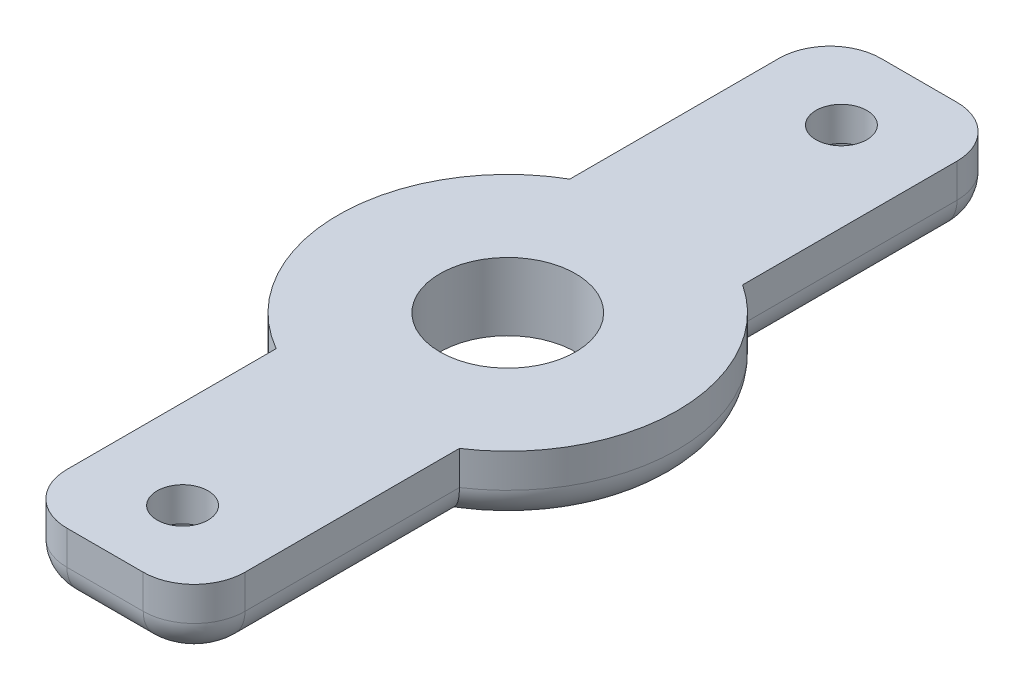
ISO-10303-21;
HEADER;
FILE_DESCRIPTION(('STEP AP214'),'2;1');
FILE_NAME('part.step','',(''),(''),'','','');
FILE_SCHEMA(('AUTOMOTIVE_DESIGN { 1 0 10303 214 1 1 1 1 }'));
ENDSEC;
DATA;
#1=APPLICATION_CONTEXT('core data for automotive mechanical design processes');
#2=APPLICATION_PROTOCOL_DEFINITION('international standard','automotive_design',2000,#1);
#3=PRODUCT_CONTEXT('',#1,'mechanical');
#4=PRODUCT('Part','Part','',(#3));
#5=PRODUCT_RELATED_PRODUCT_CATEGORY('part','',(#4));
#6=PRODUCT_DEFINITION_FORMATION('','',#4);
#7=PRODUCT_DEFINITION_CONTEXT('part definition',#1,'design');
#8=PRODUCT_DEFINITION('design','',#6,#7);
#9=PRODUCT_DEFINITION_SHAPE('','',#8);
#10=(LENGTH_UNIT() NAMED_UNIT(*) SI_UNIT(.MILLI.,.METRE.));
#11=(NAMED_UNIT(*) PLANE_ANGLE_UNIT() SI_UNIT($,.RADIAN.));
#12=(NAMED_UNIT(*) SI_UNIT($,.STERADIAN.) SOLID_ANGLE_UNIT());
#13=UNCERTAINTY_MEASURE_WITH_UNIT(LENGTH_MEASURE(1.E-05),#10,'distance_accuracy_value','');
#14=(GEOMETRIC_REPRESENTATION_CONTEXT(3) GLOBAL_UNCERTAINTY_ASSIGNED_CONTEXT((#13)) GLOBAL_UNIT_ASSIGNED_CONTEXT((#10,
#11,#12)) REPRESENTATION_CONTEXT('',''));
#15=CARTESIAN_POINT('',(0.,0.,0.));
#16=DIRECTION('',(0.,0.,1.));
#17=DIRECTION('',(1.,0.,0.));
#18=AXIS2_PLACEMENT_3D('',#15,#16,#17);
#19=CARTESIAN_POINT('',(5.25,4.,21.));
#20=DIRECTION('',(-1.,0.,0.));
#21=DIRECTION('',(0.,0.,1.));
#22=AXIS2_PLACEMENT_3D('',#19,#20,#21);
#23=PLANE('',#22);
#24=DIRECTION('',(0.,-1.,0.));
#25=VECTOR('',#24,1.);
#26=CARTESIAN_POINT('',(5.25,4.,-8.35164654424503));
#27=LINE('',#26,#25);
#28=CARTESIAN_POINT('',(5.25,4.,-8.35164654424502));
#29=VERTEX_POINT('',#28);
#30=CARTESIAN_POINT('',(5.25,2.,-8.35164654424503));
#31=VERTEX_POINT('',#30);
#32=EDGE_CURVE('E481',#29,#31,#27,.T.);
#33=ORIENTED_EDGE('',*,*,#32,.T.);
#34=DIRECTION('',(0.,0.,-1.));
#35=VECTOR('',#34,1.);
#36=CARTESIAN_POINT('',(5.25,2.,21.));
#37=LINE('',#36,#35);
#38=CARTESIAN_POINT('',(5.25000000000001,2.,-21.));
#39=VERTEX_POINT('',#38);
#40=EDGE_CURVE('E207',#31,#39,#37,.T.);
#41=ORIENTED_EDGE('',*,*,#40,.T.);
#42=DIRECTION('',(0.,-1.,0.));
#43=VECTOR('',#42,1.);
#44=CARTESIAN_POINT('',(5.25000000000001,4.,-21.));
#45=LINE('',#44,#43);
#46=CARTESIAN_POINT('',(5.25000000000001,4.,-21.));
#47=VERTEX_POINT('',#46);
#48=EDGE_CURVE('E189',#47,#39,#45,.T.);
#49=ORIENTED_EDGE('',*,*,#48,.F.);
#50=DIRECTION('',(0.,0.,-1.));
#51=VECTOR('',#50,1.);
#52=CARTESIAN_POINT('',(5.25,4.,21.));
#53=LINE('',#52,#51);
#54=EDGE_CURVE('E172',#29,#47,#53,.T.);
#55=ORIENTED_EDGE('',*,*,#54,.F.);
#56=EDGE_LOOP('',(#33,#41,#49,#55));
#57=FACE_BOUND('',#56,.T.);
#58=ADVANCED_FACE('F33',(#57),#23,.F.);
#59=CARTESIAN_POINT('',(-5.25,4.,-21.));
#60=DIRECTION('',(1.,0.,0.));
#61=DIRECTION('',(0.,0.,-1.));
#62=AXIS2_PLACEMENT_3D('',#59,#60,#61);
#63=PLANE('',#62);
#64=DIRECTION('',(0.,-1.,0.));
#65=VECTOR('',#64,1.);
#66=CARTESIAN_POINT('',(-5.25,4.,8.66025403784439));
#67=LINE('',#66,#65);
#68=CARTESIAN_POINT('',(-5.25,4.,8.66025403784439));
#69=VERTEX_POINT('',#68);
#70=CARTESIAN_POINT('',(-5.25,2.,8.66025403784439));
#71=VERTEX_POINT('',#70);
#72=EDGE_CURVE('E191',#69,#71,#67,.T.);
#73=ORIENTED_EDGE('',*,*,#72,.T.);
#74=DIRECTION('',(0.,0.,1.));
#75=VECTOR('',#74,1.);
#76=CARTESIAN_POINT('',(-5.25,2.,-21.));
#77=LINE('',#76,#75);
#78=CARTESIAN_POINT('',(-5.25,2.,21.));
#79=VERTEX_POINT('',#78);
#80=EDGE_CURVE('E42',#71,#79,#77,.T.);
#81=ORIENTED_EDGE('',*,*,#80,.T.);
#82=DIRECTION('',(0.,-1.,0.));
#83=VECTOR('',#82,1.);
#84=CARTESIAN_POINT('',(-5.25,4.,21.));
#85=LINE('',#84,#83);
#86=CARTESIAN_POINT('',(-5.25,4.,21.));
#87=VERTEX_POINT('',#86);
#88=EDGE_CURVE('E447',#87,#79,#85,.T.);
#89=ORIENTED_EDGE('',*,*,#88,.F.);
#90=DIRECTION('',(0.,0.,1.));
#91=VECTOR('',#90,1.);
#92=CARTESIAN_POINT('',(-5.25,4.,-21.));
#93=LINE('',#92,#91);
#94=EDGE_CURVE('E462',#69,#87,#93,.T.);
#95=ORIENTED_EDGE('',*,*,#94,.F.);
#96=EDGE_LOOP('',(#73,#81,#89,#95));
#97=FACE_BOUND('',#96,.T.);
#98=ADVANCED_FACE('F340',(#97),#63,.F.);
#99=CARTESIAN_POINT('',(0.,10.,-19.4285218224936));
#100=DIRECTION('',(0.,-1.,0.));
#101=DIRECTION('',(0.,0.,-1.));
#102=AXIS2_PLACEMENT_3D('',#99,#100,#101);
#103=CYLINDRICAL_SURFACE('',#102,1.50000000000003);
#104=CARTESIAN_POINT('',(0.,4.,-19.4285218224936));
#105=DIRECTION('',(0.,1.,0.));
#106=DIRECTION('',(0.,0.,1.));
#107=AXIS2_PLACEMENT_3D('',#104,#105,#106);
#108=CIRCLE('',#107,1.50000000000003);
#109=CARTESIAN_POINT('',(0.,4.,-17.9285218224935));
#110=VERTEX_POINT('',#109);
#111=EDGE_CURVE('E204',#110,#110,#108,.T.);
#112=ORIENTED_EDGE('',*,*,#111,.T.);
#113=EDGE_LOOP('',(#112));
#114=FACE_BOUND('',#113,.T.);
#115=CARTESIAN_POINT('',(0.,2.,-19.4285218224936));
#116=DIRECTION('',(0.,-1.,0.));
#117=DIRECTION('',(0.,0.,-1.));
#118=AXIS2_PLACEMENT_3D('',#115,#116,#117);
#119=CIRCLE('',#118,1.50000000000003);
#120=CARTESIAN_POINT('',(0.,2.,-20.9285218224936));
#121=VERTEX_POINT('',#120);
#122=EDGE_CURVE('E201',#121,#121,#119,.F.);
#123=ORIENTED_EDGE('',*,*,#122,.F.);
#124=EDGE_LOOP('',(#123));
#125=FACE_BOUND('',#124,.T.);
#126=ADVANCED_FACE('F346',(#114,#125),#103,.F.);
#127=CARTESIAN_POINT('',(0.,10.,19.4285218224936));
#128=DIRECTION('',(0.,-1.,0.));
#129=DIRECTION('',(0.,0.,-1.));
#130=AXIS2_PLACEMENT_3D('',#127,#128,#129);
#131=CYLINDRICAL_SURFACE('',#130,1.5);
#132=CARTESIAN_POINT('',(0.,4.,19.4285218224936));
#133=DIRECTION('',(0.,1.,0.));
#134=DIRECTION('',(0.,0.,1.));
#135=AXIS2_PLACEMENT_3D('',#132,#133,#134);
#136=CIRCLE('',#135,1.5);
#137=CARTESIAN_POINT('',(0.,4.,20.9285218224936));
#138=VERTEX_POINT('',#137);
#139=EDGE_CURVE('E470',#138,#138,#136,.T.);
#140=ORIENTED_EDGE('',*,*,#139,.T.);
#141=EDGE_LOOP('',(#140));
#142=FACE_BOUND('',#141,.T.);
#143=CARTESIAN_POINT('',(0.,2.,19.4285218224936));
#144=DIRECTION('',(0.,-1.,0.));
#145=DIRECTION('',(0.,0.,-1.));
#146=AXIS2_PLACEMENT_3D('',#143,#144,#145);
#147=CIRCLE('',#146,1.5);
#148=CARTESIAN_POINT('',(0.,2.,17.9285218224936));
#149=VERTEX_POINT('',#148);
#150=EDGE_CURVE('E198',#149,#149,#147,.F.);
#151=ORIENTED_EDGE('',*,*,#150,.F.);
#152=EDGE_LOOP('',(#151));
#153=FACE_BOUND('',#152,.T.);
#154=ADVANCED_FACE('F369',(#142,#153),#131,.F.);
#155=CARTESIAN_POINT('',(2.25,4.,21.));
#156=DIRECTION('',(0.,1.,0.));
#157=DIRECTION('',(0.,0.,1.));
#158=AXIS2_PLACEMENT_3D('',#155,#156,#157);
#159=PLANE('',#158);
#160=CARTESIAN_POINT('',(5.25,4.,21.));
#161=VERTEX_POINT('',#160);
#162=CARTESIAN_POINT('',(5.25,4.,8.35164654424504));
#163=VERTEX_POINT('',#162);
#164=EDGE_CURVE('E160',#161,#163,#53,.T.);
#165=ORIENTED_EDGE('',*,*,#164,.T.);
#166=CARTESIAN_POINT('',(-0.25,4.,0.));
#167=DIRECTION('',(0.,-1.,0.));
#168=DIRECTION('',(0.,0.,-1.));
#169=AXIS2_PLACEMENT_3D('',#166,#167,#168);
#170=CIRCLE('',#169,10.);
#171=EDGE_CURVE('E491',#29,#163,#170,.T.);
#172=ORIENTED_EDGE('',*,*,#171,.F.);
#173=ORIENTED_EDGE('',*,*,#54,.T.);
#174=CARTESIAN_POINT('',(2.25,4.,-21.));
#175=DIRECTION('',(0.,1.,0.));
#176=DIRECTION('',(0.,0.,1.));
#177=AXIS2_PLACEMENT_3D('',#174,#175,#176);
#178=CIRCLE('',#177,3.00000000000001);
#179=CARTESIAN_POINT('',(2.24999999999998,4.,-24.));
#180=VERTEX_POINT('',#179);
#181=EDGE_CURVE('E171',#47,#180,#178,.T.);
#182=ORIENTED_EDGE('',*,*,#181,.T.);
#183=DIRECTION('',(-1.,0.,0.));
#184=VECTOR('',#183,1.);
#185=CARTESIAN_POINT('',(2.24999999999998,4.,-24.));
#186=LINE('',#185,#184);
#187=CARTESIAN_POINT('',(-2.24999999999998,4.,-24.));
#188=VERTEX_POINT('',#187);
#189=EDGE_CURVE('E398',#180,#188,#186,.T.);
#190=ORIENTED_EDGE('',*,*,#189,.T.);
#191=CARTESIAN_POINT('',(-2.25,4.,-21.));
#192=DIRECTION('',(0.,1.,0.));
#193=DIRECTION('',(0.,0.,1.));
#194=AXIS2_PLACEMENT_3D('',#191,#192,#193);
#195=CIRCLE('',#194,3.);
#196=CARTESIAN_POINT('',(-5.25,4.,-21.));
#197=VERTEX_POINT('',#196);
#198=EDGE_CURVE('E463',#188,#197,#195,.T.);
#199=ORIENTED_EDGE('',*,*,#198,.T.);
#200=CARTESIAN_POINT('',(-5.25,4.,-8.66025403784439));
#201=VERTEX_POINT('',#200);
#202=EDGE_CURVE('E446',#197,#201,#93,.T.);
#203=ORIENTED_EDGE('',*,*,#202,.T.);
#204=EDGE_CURVE('E492',#69,#201,#170,.T.);
#205=ORIENTED_EDGE('',*,*,#204,.F.);
#206=ORIENTED_EDGE('',*,*,#94,.T.);
#207=CARTESIAN_POINT('',(-2.25,4.,21.));
#208=DIRECTION('',(0.,1.,0.));
#209=DIRECTION('',(0.,0.,1.));
#210=AXIS2_PLACEMENT_3D('',#207,#208,#209);
#211=CIRCLE('',#210,3.);
#212=CARTESIAN_POINT('',(-2.24999999999998,4.,24.));
#213=VERTEX_POINT('',#212);
#214=EDGE_CURVE('E459',#87,#213,#211,.T.);
#215=ORIENTED_EDGE('',*,*,#214,.T.);
#216=DIRECTION('',(1.,0.,0.));
#217=VECTOR('',#216,1.);
#218=CARTESIAN_POINT('',(-2.24999999999998,4.,24.));
#219=LINE('',#218,#217);
#220=CARTESIAN_POINT('',(2.24999999999998,4.,24.));
#221=VERTEX_POINT('',#220);
#222=EDGE_CURVE('E179',#213,#221,#219,.T.);
#223=ORIENTED_EDGE('',*,*,#222,.T.);
#224=CARTESIAN_POINT('',(2.25,4.,21.));
#225=DIRECTION('',(0.,1.,0.));
#226=DIRECTION('',(0.,0.,1.));
#227=AXIS2_PLACEMENT_3D('',#224,#225,#226);
#228=CIRCLE('',#227,3.00000000000001);
#229=EDGE_CURVE('E175',#221,#161,#228,.T.);
#230=ORIENTED_EDGE('',*,*,#229,.T.);
#231=EDGE_LOOP('',(#165,#172,#173,#182,#190,#199,#203,#205,#206,#215,#223,#230));
#232=FACE_BOUND('',#231,.T.);
#233=ORIENTED_EDGE('',*,*,#139,.F.);
#234=EDGE_LOOP('',(#233));
#235=FACE_BOUND('',#234,.T.);
#236=CARTESIAN_POINT('',(-0.25,4.,0.));
#237=DIRECTION('',(0.,1.,0.));
#238=DIRECTION('',(0.,0.,1.));
#239=AXIS2_PLACEMENT_3D('',#236,#237,#238);
#240=CIRCLE('',#239,4.);
#241=CARTESIAN_POINT('',(-0.25,4.,4.));
#242=VERTEX_POINT('',#241);
#243=EDGE_CURVE('E183',#242,#242,#240,.T.);
#244=ORIENTED_EDGE('',*,*,#243,.F.);
#245=EDGE_LOOP('',(#244));
#246=FACE_BOUND('',#245,.T.);
#247=ORIENTED_EDGE('',*,*,#111,.F.);
#248=EDGE_LOOP('',(#247));
#249=FACE_BOUND('',#248,.T.);
#250=ADVANCED_FACE('F176',(#232,#235,#246,#249),#159,.T.);
#251=CARTESIAN_POINT('',(2.25,0.,21.));
#252=DIRECTION('',(0.,1.,0.));
#253=DIRECTION('',(0.,0.,1.));
#254=AXIS2_PLACEMENT_3D('',#251,#252,#253);
#255=PLANE('',#254);
#256=DIRECTION('',(0.,0.,-1.));
#257=VECTOR('',#256,1.);
#258=CARTESIAN_POINT('',(3.25,0.,21.));
#259=LINE('',#258,#257);
#260=CARTESIAN_POINT('',(3.25000000000001,0.,-21.));
#261=VERTEX_POINT('',#260);
#262=CARTESIAN_POINT('',(3.25,0.,-7.19374728496908));
#263=VERTEX_POINT('',#262);
#264=EDGE_CURVE('E230',#261,#263,#259,.F.);
#265=ORIENTED_EDGE('',*,*,#264,.T.);
#266=CARTESIAN_POINT('',(-0.25,0.,0.));
#267=DIRECTION('',(0.,1.,0.));
#268=DIRECTION('',(0.,0.,1.));
#269=AXIS2_PLACEMENT_3D('',#266,#267,#268);
#270=CIRCLE('',#269,8.);
#271=CARTESIAN_POINT('',(3.25,0.,7.19374728496908));
#272=VERTEX_POINT('',#271);
#273=EDGE_CURVE('E233',#263,#272,#270,.F.);
#274=ORIENTED_EDGE('',*,*,#273,.T.);
#275=DIRECTION('',(0.,0.,-1.));
#276=VECTOR('',#275,1.);
#277=CARTESIAN_POINT('',(3.25,0.,21.));
#278=LINE('',#277,#276);
#279=CARTESIAN_POINT('',(3.25000000000001,0.,21.));
#280=VERTEX_POINT('',#279);
#281=EDGE_CURVE('E222',#272,#280,#278,.F.);
#282=ORIENTED_EDGE('',*,*,#281,.T.);
#283=CARTESIAN_POINT('',(2.25,0.,21.));
#284=DIRECTION('',(0.,1.,0.));
#285=DIRECTION('',(0.,0.,1.));
#286=AXIS2_PLACEMENT_3D('',#283,#284,#285);
#287=CIRCLE('',#286,1.00000000000001);
#288=CARTESIAN_POINT('',(2.24999999999999,0.,22.));
#289=VERTEX_POINT('',#288);
#290=EDGE_CURVE('E220',#280,#289,#287,.F.);
#291=ORIENTED_EDGE('',*,*,#290,.T.);
#292=DIRECTION('',(1.,0.,0.));
#293=VECTOR('',#292,1.);
#294=CARTESIAN_POINT('',(2.25,0.,22.));
#295=LINE('',#294,#293);
#296=CARTESIAN_POINT('',(-2.24999999999999,0.,22.));
#297=VERTEX_POINT('',#296);
#298=EDGE_CURVE('E218',#289,#297,#295,.F.);
#299=ORIENTED_EDGE('',*,*,#298,.T.);
#300=CARTESIAN_POINT('',(-2.25,0.,21.));
#301=DIRECTION('',(0.,1.,0.));
#302=DIRECTION('',(0.,0.,1.));
#303=AXIS2_PLACEMENT_3D('',#300,#301,#302);
#304=CIRCLE('',#303,0.999999999999997);
#305=CARTESIAN_POINT('',(-3.25,0.,21.));
#306=VERTEX_POINT('',#305);
#307=EDGE_CURVE('E216',#297,#306,#304,.F.);
#308=ORIENTED_EDGE('',*,*,#307,.T.);
#309=DIRECTION('',(0.,0.,1.));
#310=VECTOR('',#309,1.);
#311=CARTESIAN_POINT('',(-3.25,0.,21.));
#312=LINE('',#311,#310);
#313=CARTESIAN_POINT('',(-3.25,0.,7.41619848709567));
#314=VERTEX_POINT('',#313);
#315=EDGE_CURVE('E212',#306,#314,#312,.F.);
#316=ORIENTED_EDGE('',*,*,#315,.T.);
#317=CARTESIAN_POINT('',(-0.25,0.,0.));
#318=DIRECTION('',(0.,1.,0.));
#319=DIRECTION('',(0.,0.,1.));
#320=AXIS2_PLACEMENT_3D('',#317,#318,#319);
#321=CIRCLE('',#320,8.);
#322=CARTESIAN_POINT('',(-3.25,0.,-7.41619848709566));
#323=VERTEX_POINT('',#322);
#324=EDGE_CURVE('E210',#314,#323,#321,.F.);
#325=ORIENTED_EDGE('',*,*,#324,.T.);
#326=DIRECTION('',(0.,0.,1.));
#327=VECTOR('',#326,1.);
#328=CARTESIAN_POINT('',(-3.25,0.,21.));
#329=LINE('',#328,#327);
#330=CARTESIAN_POINT('',(-3.25,0.,-21.));
#331=VERTEX_POINT('',#330);
#332=EDGE_CURVE('E214',#323,#331,#329,.F.);
#333=ORIENTED_EDGE('',*,*,#332,.T.);
#334=CARTESIAN_POINT('',(-2.25,0.,-21.));
#335=DIRECTION('',(0.,1.,0.));
#336=DIRECTION('',(0.,0.,1.));
#337=AXIS2_PLACEMENT_3D('',#334,#335,#336);
#338=CIRCLE('',#337,0.999999999999997);
#339=CARTESIAN_POINT('',(-2.24999999999998,0.,-22.));
#340=VERTEX_POINT('',#339);
#341=EDGE_CURVE('E224',#331,#340,#338,.F.);
#342=ORIENTED_EDGE('',*,*,#341,.T.);
#343=DIRECTION('',(-1.,0.,0.));
#344=VECTOR('',#343,1.);
#345=CARTESIAN_POINT('',(2.25000000000006,0.,-22.));
#346=LINE('',#345,#344);
#347=CARTESIAN_POINT('',(2.24999999999999,0.,-22.));
#348=VERTEX_POINT('',#347);
#349=EDGE_CURVE('E226',#340,#348,#346,.F.);
#350=ORIENTED_EDGE('',*,*,#349,.T.);
#351=CARTESIAN_POINT('',(2.25,0.,-21.));
#352=DIRECTION('',(0.,1.,0.));
#353=DIRECTION('',(0.,0.,1.));
#354=AXIS2_PLACEMENT_3D('',#351,#352,#353);
#355=CIRCLE('',#354,1.00000000000001);
#356=EDGE_CURVE('E228',#348,#261,#355,.F.);
#357=ORIENTED_EDGE('',*,*,#356,.T.);
#358=EDGE_LOOP('',(#265,#274,#282,#291,#299,#308,#316,#325,#333,#342,#350,#357));
#359=FACE_BOUND('',#358,.T.);
#360=CARTESIAN_POINT('',(0.,0.,19.4285218224936));
#361=DIRECTION('',(0.,-1.,0.));
#362=DIRECTION('',(0.,0.,-1.));
#363=AXIS2_PLACEMENT_3D('',#360,#361,#362);
#364=CIRCLE('',#363,2.5);
#365=CARTESIAN_POINT('',(0.,0.,16.9285218224936));
#366=VERTEX_POINT('',#365);
#367=EDGE_CURVE('E484',#366,#366,#364,.T.);
#368=ORIENTED_EDGE('',*,*,#367,.F.);
#369=EDGE_LOOP('',(#368));
#370=FACE_BOUND('',#369,.T.);
#371=CARTESIAN_POINT('',(-0.25,0.,0.));
#372=DIRECTION('',(0.,1.,0.));
#373=DIRECTION('',(0.,0.,1.));
#374=AXIS2_PLACEMENT_3D('',#371,#372,#373);
#375=CIRCLE('',#374,4.);
#376=CARTESIAN_POINT('',(-0.25,0.,4.));
#377=VERTEX_POINT('',#376);
#378=EDGE_CURVE('E467',#377,#377,#375,.T.);
#379=ORIENTED_EDGE('',*,*,#378,.T.);
#380=EDGE_LOOP('',(#379));
#381=FACE_BOUND('',#380,.T.);
#382=CARTESIAN_POINT('',(0.,0.,-19.4285218224936));
#383=DIRECTION('',(0.,-1.,0.));
#384=DIRECTION('',(0.,0.,-1.));
#385=AXIS2_PLACEMENT_3D('',#382,#383,#384);
#386=CIRCLE('',#385,2.5);
#387=CARTESIAN_POINT('',(0.,0.,-21.9285218224936));
#388=VERTEX_POINT('',#387);
#389=EDGE_CURVE('E477',#388,#388,#386,.T.);
#390=ORIENTED_EDGE('',*,*,#389,.F.);
#391=EDGE_LOOP('',(#390));
#392=FACE_BOUND('',#391,.T.);
#393=ADVANCED_FACE('F360',(#359,#370,#381,#392),#255,.F.);
#394=CARTESIAN_POINT('',(2.25,4.,21.));
#395=DIRECTION('',(0.,-1.,0.));
#396=DIRECTION('',(0.,0.,-1.));
#397=AXIS2_PLACEMENT_3D('',#394,#395,#396);
#398=CYLINDRICAL_SURFACE('',#397,3.00000000000001);
#399=DIRECTION('',(0.,-1.,0.));
#400=VECTOR('',#399,1.);
#401=CARTESIAN_POINT('',(2.24999999999998,4.,24.));
#402=LINE('',#401,#400);
#403=CARTESIAN_POINT('',(2.24999999999998,2.,24.));
#404=VERTEX_POINT('',#403);
#405=EDGE_CURVE('E456',#221,#404,#402,.T.);
#406=ORIENTED_EDGE('',*,*,#405,.T.);
#407=CARTESIAN_POINT('',(2.25,2.,21.));
#408=DIRECTION('',(0.,1.,0.));
#409=DIRECTION('',(0.,0.,1.));
#410=AXIS2_PLACEMENT_3D('',#407,#408,#409);
#411=CIRCLE('',#410,3.00000000000001);
#412=CARTESIAN_POINT('',(5.25,2.,21.));
#413=VERTEX_POINT('',#412);
#414=EDGE_CURVE('E187',#404,#413,#411,.T.);
#415=ORIENTED_EDGE('',*,*,#414,.T.);
#416=DIRECTION('',(0.,-1.,0.));
#417=VECTOR('',#416,1.);
#418=CARTESIAN_POINT('',(5.25,4.,21.));
#419=LINE('',#418,#417);
#420=EDGE_CURVE('E164',#161,#413,#419,.T.);
#421=ORIENTED_EDGE('',*,*,#420,.F.);
#422=ORIENTED_EDGE('',*,*,#229,.F.);
#423=EDGE_LOOP('',(#406,#415,#421,#422));
#424=FACE_BOUND('',#423,.T.);
#425=ADVANCED_FACE('F185',(#424),#398,.T.);
#426=ORIENTED_EDGE('',*,*,#420,.T.);
#427=DIRECTION('',(0.,0.,-1.));
#428=VECTOR('',#427,1.);
#429=CARTESIAN_POINT('',(5.25,2.,21.));
#430=LINE('',#429,#428);
#431=CARTESIAN_POINT('',(5.25,2.,8.35164654424504));
#432=VERTEX_POINT('',#431);
#433=EDGE_CURVE('E241',#413,#432,#430,.T.);
#434=ORIENTED_EDGE('',*,*,#433,.T.);
#435=DIRECTION('',(0.,-1.,0.));
#436=VECTOR('',#435,1.);
#437=CARTESIAN_POINT('',(5.25,4.,8.35164654424504));
#438=LINE('',#437,#436);
#439=EDGE_CURVE('E167',#432,#163,#438,.F.);
#440=ORIENTED_EDGE('',*,*,#439,.T.);
#441=ORIENTED_EDGE('',*,*,#164,.F.);
#442=EDGE_LOOP('',(#426,#434,#440,#441));
#443=FACE_BOUND('',#442,.T.);
#444=ADVANCED_FACE('F162',(#443),#23,.F.);
#445=CARTESIAN_POINT('',(2.25,4.,-21.));
#446=DIRECTION('',(0.,-1.,0.));
#447=DIRECTION('',(0.,0.,-1.));
#448=AXIS2_PLACEMENT_3D('',#445,#446,#447);
#449=CYLINDRICAL_SURFACE('',#448,3.00000000000001);
#450=ORIENTED_EDGE('',*,*,#48,.T.);
#451=CARTESIAN_POINT('',(2.25,2.,-21.));
#452=DIRECTION('',(0.,1.,0.));
#453=DIRECTION('',(0.,0.,1.));
#454=AXIS2_PLACEMENT_3D('',#451,#452,#453);
#455=CIRCLE('',#454,3.00000000000001);
#456=CARTESIAN_POINT('',(2.24999999999998,2.,-24.));
#457=VERTEX_POINT('',#456);
#458=EDGE_CURVE('E235',#39,#457,#455,.T.);
#459=ORIENTED_EDGE('',*,*,#458,.T.);
#460=DIRECTION('',(0.,-1.,0.));
#461=VECTOR('',#460,1.);
#462=CARTESIAN_POINT('',(2.24999999999998,4.,-24.));
#463=LINE('',#462,#461);
#464=EDGE_CURVE('E194',#180,#457,#463,.T.);
#465=ORIENTED_EDGE('',*,*,#464,.F.);
#466=ORIENTED_EDGE('',*,*,#181,.F.);
#467=EDGE_LOOP('',(#450,#459,#465,#466));
#468=FACE_BOUND('',#467,.T.);
#469=ADVANCED_FACE('F353',(#468),#449,.T.);
#470=CARTESIAN_POINT('',(2.24999999999998,4.,-24.));
#471=DIRECTION('',(0.,0.,1.));
#472=DIRECTION('',(1.,0.,0.));
#473=AXIS2_PLACEMENT_3D('',#470,#471,#472);
#474=PLANE('',#473);
#475=ORIENTED_EDGE('',*,*,#464,.T.);
#476=DIRECTION('',(-1.,0.,0.));
#477=VECTOR('',#476,1.);
#478=CARTESIAN_POINT('',(2.24999999999998,2.,-24.));
#479=LINE('',#478,#477);
#480=CARTESIAN_POINT('',(-2.24999999999998,2.,-24.));
#481=VERTEX_POINT('',#480);
#482=EDGE_CURVE('E237',#457,#481,#479,.T.);
#483=ORIENTED_EDGE('',*,*,#482,.T.);
#484=DIRECTION('',(0.,-1.,0.));
#485=VECTOR('',#484,1.);
#486=CARTESIAN_POINT('',(-2.24999999999998,4.,-24.));
#487=LINE('',#486,#485);
#488=EDGE_CURVE('E400',#188,#481,#487,.T.);
#489=ORIENTED_EDGE('',*,*,#488,.F.);
#490=ORIENTED_EDGE('',*,*,#189,.F.);
#491=EDGE_LOOP('',(#475,#483,#489,#490));
#492=FACE_BOUND('',#491,.T.);
#493=ADVANCED_FACE('F358',(#492),#474,.F.);
#494=CARTESIAN_POINT('',(-2.25,4.,-21.));
#495=DIRECTION('',(0.,-1.,0.));
#496=DIRECTION('',(0.,0.,-1.));
#497=AXIS2_PLACEMENT_3D('',#494,#495,#496);
#498=CYLINDRICAL_SURFACE('',#497,3.);
#499=ORIENTED_EDGE('',*,*,#488,.T.);
#500=CARTESIAN_POINT('',(-2.25,2.,-21.));
#501=DIRECTION('',(0.,1.,0.));
#502=DIRECTION('',(0.,0.,1.));
#503=AXIS2_PLACEMENT_3D('',#500,#501,#502);
#504=CIRCLE('',#503,3.);
#505=CARTESIAN_POINT('',(-5.25,2.,-21.));
#506=VERTEX_POINT('',#505);
#507=EDGE_CURVE('E239',#481,#506,#504,.T.);
#508=ORIENTED_EDGE('',*,*,#507,.T.);
#509=DIRECTION('',(0.,-1.,0.));
#510=VECTOR('',#509,1.);
#511=CARTESIAN_POINT('',(-5.25,4.,-21.));
#512=LINE('',#511,#510);
#513=EDGE_CURVE('E443',#197,#506,#512,.T.);
#514=ORIENTED_EDGE('',*,*,#513,.F.);
#515=ORIENTED_EDGE('',*,*,#198,.F.);
#516=EDGE_LOOP('',(#499,#508,#514,#515));
#517=FACE_BOUND('',#516,.T.);
#518=ADVANCED_FACE('F384',(#517),#498,.T.);
#519=ORIENTED_EDGE('',*,*,#513,.T.);
#520=DIRECTION('',(0.,0.,1.));
#521=VECTOR('',#520,1.);
#522=CARTESIAN_POINT('',(-5.25,2.,-21.));
#523=LINE('',#522,#521);
#524=CARTESIAN_POINT('',(-5.25,2.,-8.66025403784439));
#525=VERTEX_POINT('',#524);
#526=EDGE_CURVE('E56',#506,#525,#523,.T.);
#527=ORIENTED_EDGE('',*,*,#526,.T.);
#528=DIRECTION('',(0.,-1.,0.));
#529=VECTOR('',#528,1.);
#530=CARTESIAN_POINT('',(-5.25,4.,-8.66025403784439));
#531=LINE('',#530,#529);
#532=EDGE_CURVE('E188',#525,#201,#531,.F.);
#533=ORIENTED_EDGE('',*,*,#532,.T.);
#534=ORIENTED_EDGE('',*,*,#202,.F.);
#535=EDGE_LOOP('',(#519,#527,#533,#534));
#536=FACE_BOUND('',#535,.T.);
#537=ADVANCED_FACE('F349',(#536),#63,.F.);
#538=CARTESIAN_POINT('',(-2.25,4.,21.));
#539=DIRECTION('',(0.,-1.,0.));
#540=DIRECTION('',(0.,0.,-1.));
#541=AXIS2_PLACEMENT_3D('',#538,#539,#540);
#542=CYLINDRICAL_SURFACE('',#541,3.);
#543=ORIENTED_EDGE('',*,*,#88,.T.);
#544=CARTESIAN_POINT('',(-2.25,2.,21.));
#545=DIRECTION('',(0.,1.,0.));
#546=DIRECTION('',(0.,0.,1.));
#547=AXIS2_PLACEMENT_3D('',#544,#545,#546);
#548=CIRCLE('',#547,3.);
#549=CARTESIAN_POINT('',(-2.24999999999998,2.,24.));
#550=VERTEX_POINT('',#549);
#551=EDGE_CURVE('E246',#79,#550,#548,.T.);
#552=ORIENTED_EDGE('',*,*,#551,.T.);
#553=DIRECTION('',(0.,-1.,0.));
#554=VECTOR('',#553,1.);
#555=CARTESIAN_POINT('',(-2.24999999999998,4.,24.));
#556=LINE('',#555,#554);
#557=EDGE_CURVE('E451',#213,#550,#556,.T.);
#558=ORIENTED_EDGE('',*,*,#557,.F.);
#559=ORIENTED_EDGE('',*,*,#214,.F.);
#560=EDGE_LOOP('',(#543,#552,#558,#559));
#561=FACE_BOUND('',#560,.T.);
#562=ADVANCED_FACE('F378',(#561),#542,.T.);
#563=CARTESIAN_POINT('',(-2.24999999999998,4.,24.));
#564=DIRECTION('',(0.,0.,-1.));
#565=DIRECTION('',(-1.,0.,0.));
#566=AXIS2_PLACEMENT_3D('',#563,#564,#565);
#567=PLANE('',#566);
#568=ORIENTED_EDGE('',*,*,#557,.T.);
#569=DIRECTION('',(1.,0.,0.));
#570=VECTOR('',#569,1.);
#571=CARTESIAN_POINT('',(-2.24999999999998,2.,24.));
#572=LINE('',#571,#570);
#573=EDGE_CURVE('E244',#550,#404,#572,.T.);
#574=ORIENTED_EDGE('',*,*,#573,.T.);
#575=ORIENTED_EDGE('',*,*,#405,.F.);
#576=ORIENTED_EDGE('',*,*,#222,.F.);
#577=EDGE_LOOP('',(#568,#574,#575,#576));
#578=FACE_BOUND('',#577,.T.);
#579=ADVANCED_FACE('F374',(#578),#567,.F.);
#580=CARTESIAN_POINT('',(-0.25,4.,0.));
#581=DIRECTION('',(0.,-1.,0.));
#582=DIRECTION('',(0.,0.,-1.));
#583=AXIS2_PLACEMENT_3D('',#580,#581,#582);
#584=CYLINDRICAL_SURFACE('',#583,4.);
#585=ORIENTED_EDGE('',*,*,#243,.T.);
#586=EDGE_LOOP('',(#585));
#587=FACE_BOUND('',#586,.T.);
#588=ORIENTED_EDGE('',*,*,#378,.F.);
#589=EDGE_LOOP('',(#588));
#590=FACE_BOUND('',#589,.T.);
#591=ADVANCED_FACE('F377',(#587,#590),#584,.F.);
#592=CARTESIAN_POINT('',(0.,2.,19.4285218224936));
#593=DIRECTION('',(0.,-1.,0.));
#594=DIRECTION('',(0.,0.,-1.));
#595=AXIS2_PLACEMENT_3D('',#592,#593,#594);
#596=PLANE('',#595);
#597=CARTESIAN_POINT('',(0.,2.,19.4285218224936));
#598=DIRECTION('',(0.,-1.,0.));
#599=DIRECTION('',(0.,0.,-1.));
#600=AXIS2_PLACEMENT_3D('',#597,#598,#599);
#601=CIRCLE('',#600,2.5);
#602=CARTESIAN_POINT('',(0.,2.,16.9285218224936));
#603=VERTEX_POINT('',#602);
#604=EDGE_CURVE('E202',#603,#603,#601,.T.);
#605=ORIENTED_EDGE('',*,*,#604,.T.);
#606=EDGE_LOOP('',(#605));
#607=FACE_BOUND('',#606,.T.);
#608=ORIENTED_EDGE('',*,*,#150,.T.);
#609=EDGE_LOOP('',(#608));
#610=FACE_BOUND('',#609,.T.);
#611=ADVANCED_FACE('F509',(#607,#610),#596,.T.);
#612=CARTESIAN_POINT('',(0.,2.,19.4285218224936));
#613=DIRECTION('',(0.,-1.,0.));
#614=DIRECTION('',(0.,0.,-1.));
#615=AXIS2_PLACEMENT_3D('',#612,#613,#614);
#616=CYLINDRICAL_SURFACE('',#615,2.5);
#617=ORIENTED_EDGE('',*,*,#604,.F.);
#618=EDGE_LOOP('',(#617));
#619=FACE_BOUND('',#618,.T.);
#620=ORIENTED_EDGE('',*,*,#367,.T.);
#621=EDGE_LOOP('',(#620));
#622=FACE_BOUND('',#621,.T.);
#623=ADVANCED_FACE('F512',(#619,#622),#616,.F.);
#624=CARTESIAN_POINT('',(0.,2.,-19.4285218224936));
#625=DIRECTION('',(0.,-1.,0.));
#626=DIRECTION('',(0.,0.,-1.));
#627=AXIS2_PLACEMENT_3D('',#624,#625,#626);
#628=PLANE('',#627);
#629=CARTESIAN_POINT('',(0.,2.,-19.4285218224936));
#630=DIRECTION('',(0.,-1.,0.));
#631=DIRECTION('',(0.,0.,-1.));
#632=AXIS2_PLACEMENT_3D('',#629,#630,#631);
#633=CIRCLE('',#632,2.5);
#634=CARTESIAN_POINT('',(0.,2.,-21.9285218224936));
#635=VERTEX_POINT('',#634);
#636=EDGE_CURVE('E480',#635,#635,#633,.T.);
#637=ORIENTED_EDGE('',*,*,#636,.T.);
#638=EDGE_LOOP('',(#637));
#639=FACE_BOUND('',#638,.T.);
#640=ORIENTED_EDGE('',*,*,#122,.T.);
#641=EDGE_LOOP('',(#640));
#642=FACE_BOUND('',#641,.T.);
#643=ADVANCED_FACE('F505',(#639,#642),#628,.T.);
#644=CARTESIAN_POINT('',(0.,2.,-19.4285218224936));
#645=DIRECTION('',(0.,-1.,0.));
#646=DIRECTION('',(0.,0.,-1.));
#647=AXIS2_PLACEMENT_3D('',#644,#645,#646);
#648=CYLINDRICAL_SURFACE('',#647,2.5);
#649=ORIENTED_EDGE('',*,*,#636,.F.);
#650=EDGE_LOOP('',(#649));
#651=FACE_BOUND('',#650,.T.);
#652=ORIENTED_EDGE('',*,*,#389,.T.);
#653=EDGE_LOOP('',(#652));
#654=FACE_BOUND('',#653,.T.);
#655=ADVANCED_FACE('F501',(#651,#654),#648,.F.);
#656=CARTESIAN_POINT('',(-0.25,4.,0.));
#657=DIRECTION('',(0.,-1.,0.));
#658=DIRECTION('',(0.,0.,-1.));
#659=AXIS2_PLACEMENT_3D('',#656,#657,#658);
#660=CYLINDRICAL_SURFACE('',#659,10.);
#661=ORIENTED_EDGE('',*,*,#532,.F.);
#662=CARTESIAN_POINT('',(-0.25,2.,0.));
#663=DIRECTION('',(0.,1.,0.));
#664=DIRECTION('',(0.,0.,1.));
#665=AXIS2_PLACEMENT_3D('',#662,#663,#664);
#666=CIRCLE('',#665,10.);
#667=EDGE_CURVE('E11',#525,#71,#666,.T.);
#668=ORIENTED_EDGE('',*,*,#667,.T.);
#669=ORIENTED_EDGE('',*,*,#72,.F.);
#670=ORIENTED_EDGE('',*,*,#204,.T.);
#671=EDGE_LOOP('',(#661,#668,#669,#670));
#672=FACE_BOUND('',#671,.T.);
#673=ADVANCED_FACE('F335',(#672),#660,.T.);
#674=ORIENTED_EDGE('',*,*,#439,.F.);
#675=CARTESIAN_POINT('',(-0.25,2.,0.));
#676=DIRECTION('',(0.,1.,0.));
#677=DIRECTION('',(0.,0.,1.));
#678=AXIS2_PLACEMENT_3D('',#675,#676,#677);
#679=CIRCLE('',#678,10.);
#680=EDGE_CURVE('E249',#432,#31,#679,.T.);
#681=ORIENTED_EDGE('',*,*,#680,.T.);
#682=ORIENTED_EDGE('',*,*,#32,.F.);
#683=ORIENTED_EDGE('',*,*,#171,.T.);
#684=EDGE_LOOP('',(#674,#681,#682,#683));
#685=FACE_BOUND('',#684,.T.);
#686=ADVANCED_FACE('F328',(#685),#660,.T.);
#687=CARTESIAN_POINT('',(-3.25,2.,-21.));
#688=DIRECTION('',(0.,0.,1.));
#689=DIRECTION('',(1.,0.,0.));
#690=AXIS2_PLACEMENT_3D('',#687,#688,#689);
#691=CYLINDRICAL_SURFACE('',#690,2.);
#692=CARTESIAN_POINT('',(-5.25,2.,8.66025403784439));
#693=CARTESIAN_POINT('',(-5.25000857828605,1.9493033876818,8.66025809940056));
#694=CARTESIAN_POINT('',(-5.2480726043955,1.89861143874987,8.65914123338118));
#695=CARTESIAN_POINT('',(-5.24037714359612,1.79763107015685,8.65469701706699));
#696=CARTESIAN_POINT('',(-5.23461881440431,1.7473425329764,8.65137033608189));
#697=CARTESIAN_POINT('',(-5.21937458140785,1.64773081318408,8.64255541618371));
#698=CARTESIAN_POINT('',(-5.20990361625807,1.59840458330099,8.63707583974779));
#699=CARTESIAN_POINT('',(-5.18736538754227,1.50087664132802,8.62401856578884));
#700=CARTESIAN_POINT('',(-5.17429799162599,1.45267497069326,8.61644079105113));
#701=CARTESIAN_POINT('',(-5.1299465842752,1.31032940383222,8.5906789200359));
#702=CARTESIAN_POINT('',(-5.09348726228278,1.21827829465239,8.56945128769586));
#703=CARTESIAN_POINT('',(-5.00843488092064,1.0421364344717,8.51968101498686));
#704=CARTESIAN_POINT('',(-4.9598328833025,0.958051610634122,8.49113298564886));
#705=CARTESIAN_POINT('',(-4.8498624327042,0.795632094079098,8.42613358827095));
#706=CARTESIAN_POINT('',(-4.78799850237471,0.717758110289206,8.38937203274734));
#707=CARTESIAN_POINT('',(-4.65532293017597,0.573578206182028,8.30992222342924));
#708=CARTESIAN_POINT('',(-4.5845092940803,0.507274871969089,8.26723264850838));
#709=CARTESIAN_POINT('',(-4.42674899547396,0.379250523859102,8.17129516027823));
#710=CARTESIAN_POINT('',(-4.3388924669823,0.319142289863885,8.1173945023538));
#711=CARTESIAN_POINT('',(-4.15718309724362,0.214493277397186,8.00468697915293));
#712=CARTESIAN_POINT('',(-4.06332338432946,0.169970730705519,7.94587446700477));
#713=CARTESIAN_POINT('',(-3.85218143806357,0.0887998490412005,7.81198868799628));
#714=CARTESIAN_POINT('',(-3.7340749787925,0.0556933797644308,7.73607078147067));
#715=CARTESIAN_POINT('',(-3.49628816038372,0.0115506192949679,7.58082390379346));
#716=CARTESIAN_POINT('',(-3.37661116390089,0.000473102362647788,7.50150158864299));
#717=CARTESIAN_POINT('',(-3.25513524395049,4.93805669818974E-06,7.41966006674632));
#718=CARTESIAN_POINT('',(-3.25256743417533,-5.98682240586462E-09,7.41792945598609));
#719=CARTESIAN_POINT('',(-3.25,0.,7.41619848709567));
#720=B_SPLINE_CURVE_WITH_KNOTS('',3,(#692,#693,#694,#695,#696,#697,#698,#699,#700,#701,#702,
#703,#704,#705,#706,#707,#708,#709,#710,#711,#712,#713,#714,#715,#716,#717,#718,#719),
.UNSPECIFIED.,.F.,.F.,(4,2,2,2,2,2,2,2,2,2,2,2,2,4),(0.,0.152032753048417,0.30401947933425,
0.455400827450668,0.606787747212896,0.909060013550453,1.21155544208785,1.52837226773112,
1.84525981325291,2.20181817883787,2.55879225529753,2.98971636370608,3.41983326412029,
3.42912292529623),.UNSPECIFIED.);
#721=EDGE_CURVE('E320',#314,#71,#720,.F.);
#722=ORIENTED_EDGE('',*,*,#721,.F.);
#723=ORIENTED_EDGE('',*,*,#315,.F.);
#724=CARTESIAN_POINT('',(-3.25,2.,21.));
#725=DIRECTION('',(0.,0.,1.));
#726=DIRECTION('',(0.,-1.,0.));
#727=AXIS2_PLACEMENT_3D('',#724,#725,#726);
#728=CIRCLE('',#727,2.);
#729=EDGE_CURVE('E37',#79,#306,#728,.T.);
#730=ORIENTED_EDGE('',*,*,#729,.F.);
#731=ORIENTED_EDGE('',*,*,#80,.F.);
#732=EDGE_LOOP('',(#722,#723,#730,#731));
#733=FACE_BOUND('',#732,.T.);
#734=ADVANCED_FACE('F325',(#733),#691,.T.);
#735=CARTESIAN_POINT('',(-2.25,2.,21.));
#736=DIRECTION('',(0.,1.,0.));
#737=DIRECTION('',(0.,0.,1.));
#738=AXIS2_PLACEMENT_3D('',#735,#736,#737);
#739=DEGENERATE_TOROIDAL_SURFACE('',#738,0.999999999999997,2.,.T.);
#740=ORIENTED_EDGE('',*,*,#729,.T.);
#741=ORIENTED_EDGE('',*,*,#307,.F.);
#742=CARTESIAN_POINT('',(-2.25,2.,22.));
#743=DIRECTION('',(1.,0.,0.));
#744=DIRECTION('',(0.,0.,-1.));
#745=AXIS2_PLACEMENT_3D('',#742,#743,#744);
#746=CIRCLE('',#745,2.);
#747=EDGE_CURVE('E309',#550,#297,#746,.T.);
#748=ORIENTED_EDGE('',*,*,#747,.F.);
#749=ORIENTED_EDGE('',*,*,#551,.F.);
#750=EDGE_LOOP('',(#740,#741,#748,#749));
#751=FACE_BOUND('',#750,.T.);
#752=ADVANCED_FACE('F35',(#751),#739,.T.);
#753=CARTESIAN_POINT('',(-0.25,2.,0.));
#754=DIRECTION('',(0.,1.,0.));
#755=DIRECTION('',(0.,0.,1.));
#756=AXIS2_PLACEMENT_3D('',#753,#754,#755);
#757=TOROIDAL_SURFACE('',#756,8.,2.);
#758=ORIENTED_EDGE('',*,*,#721,.T.);
#759=ORIENTED_EDGE('',*,*,#667,.F.);
#760=CARTESIAN_POINT('',(-5.25,2.,-8.66025403784439));
#761=CARTESIAN_POINT('',(-5.25000857828605,1.9493033876818,-8.66025809940055));
#762=CARTESIAN_POINT('',(-5.2480726043955,1.89861143874987,-8.65914123338117));
#763=CARTESIAN_POINT('',(-5.24037714359612,1.79763107015685,-8.65469701706698));
#764=CARTESIAN_POINT('',(-5.23461881440431,1.7473425329764,-8.65137033608188));
#765=CARTESIAN_POINT('',(-5.21937458140785,1.64773081318408,-8.6425554161837));
#766=CARTESIAN_POINT('',(-5.20990361625807,1.59840458330099,-8.63707583974778));
#767=CARTESIAN_POINT('',(-5.18736538754227,1.50087664132802,-8.62401856578884));
#768=CARTESIAN_POINT('',(-5.17429799162599,1.45267497069326,-8.61644079105113));
#769=CARTESIAN_POINT('',(-5.1299465842752,1.31032940383222,-8.5906789200359));
#770=CARTESIAN_POINT('',(-5.09348726228278,1.21827829465239,-8.56945128769585));
#771=CARTESIAN_POINT('',(-5.00843488092064,1.0421364344717,-8.51968101498686));
#772=CARTESIAN_POINT('',(-4.9598328833025,0.958051610634122,-8.49113298564885));
#773=CARTESIAN_POINT('',(-4.8498624327042,0.795632094079098,-8.42613358827095));
#774=CARTESIAN_POINT('',(-4.78799850237471,0.717758110289206,-8.38937203274734));
#775=CARTESIAN_POINT('',(-4.65532293017597,0.573578206182028,-8.30992222342923));
#776=CARTESIAN_POINT('',(-4.5845092940803,0.507274871969088,-8.26723264850837));
#777=CARTESIAN_POINT('',(-4.42674899547396,0.379250523859102,-8.17129516027823));
#778=CARTESIAN_POINT('',(-4.3388924669823,0.319142289863885,-8.11739450235379));
#779=CARTESIAN_POINT('',(-4.15718309724362,0.214493277397186,-8.00468697915293));
#780=CARTESIAN_POINT('',(-4.06332338432946,0.169970730705519,-7.94587446700476));
#781=CARTESIAN_POINT('',(-3.85218143806357,0.0887998490412005,-7.81198868799627));
#782=CARTESIAN_POINT('',(-3.7340749787925,0.0556933797644308,-7.73607078147066));
#783=CARTESIAN_POINT('',(-3.49628816038372,0.0115506192949679,-7.58082390379346));
#784=CARTESIAN_POINT('',(-3.37661116390089,0.000473102362647788,-7.50150158864299));
#785=CARTESIAN_POINT('',(-3.25513524395049,4.93805669818974E-06,-7.41966006674631));
#786=CARTESIAN_POINT('',(-3.25256743417533,-5.98682240586462E-09,-7.41792945598608));
#787=CARTESIAN_POINT('',(-3.25,0.,-7.41619848709566));
#788=B_SPLINE_CURVE_WITH_KNOTS('',3,(#760,#761,#762,#763,#764,#765,#766,#767,#768,#769,#770,
#771,#772,#773,#774,#775,#776,#777,#778,#779,#780,#781,#782,#783,#784,#785,#786,#787),
.UNSPECIFIED.,.F.,.F.,(4,2,2,2,2,2,2,2,2,2,2,2,2,4),(0.,0.152032753048417,0.30401947933425,
0.455400827450668,0.606787747212896,0.909060013550453,1.21155544208785,1.52837226773112,
1.84525981325291,2.20181817883787,2.55879225529753,2.98971636370608,3.41983326412029,
3.42912292529623),.UNSPECIFIED.);
#789=EDGE_CURVE('E301',#323,#525,#788,.F.);
#790=ORIENTED_EDGE('',*,*,#789,.F.);
#791=ORIENTED_EDGE('',*,*,#324,.F.);
#792=EDGE_LOOP('',(#758,#759,#790,#791));
#793=FACE_BOUND('',#792,.T.);
#794=ADVANCED_FACE('F313',(#793),#757,.T.);
#795=CARTESIAN_POINT('',(-2.24999999999999,2.,22.));
#796=DIRECTION('',(1.,0.,0.));
#797=DIRECTION('',(0.,0.,-1.));
#798=AXIS2_PLACEMENT_3D('',#795,#796,#797);
#799=CYLINDRICAL_SURFACE('',#798,2.);
#800=ORIENTED_EDGE('',*,*,#747,.T.);
#801=ORIENTED_EDGE('',*,*,#298,.F.);
#802=CARTESIAN_POINT('',(2.24999999999998,2.,22.));
#803=DIRECTION('',(1.,0.,0.));
#804=DIRECTION('',(0.,1.,0.));
#805=AXIS2_PLACEMENT_3D('',#802,#803,#804);
#806=CIRCLE('',#805,2.);
#807=EDGE_CURVE('E298',#404,#289,#806,.T.);
#808=ORIENTED_EDGE('',*,*,#807,.F.);
#809=ORIENTED_EDGE('',*,*,#573,.F.);
#810=EDGE_LOOP('',(#800,#801,#808,#809));
#811=FACE_BOUND('',#810,.T.);
#812=ADVANCED_FACE('F317',(#811),#799,.T.);
#813=CARTESIAN_POINT('',(-3.25,2.,-21.));
#814=DIRECTION('',(0.,0.,1.));
#815=DIRECTION('',(1.,0.,0.));
#816=AXIS2_PLACEMENT_3D('',#813,#814,#815);
#817=CYLINDRICAL_SURFACE('',#816,2.);
#818=ORIENTED_EDGE('',*,*,#789,.T.);
#819=ORIENTED_EDGE('',*,*,#526,.F.);
#820=CARTESIAN_POINT('',(-3.25,2.,-21.));
#821=DIRECTION('',(0.,0.,-1.));
#822=DIRECTION('',(-1.,0.,0.));
#823=AXIS2_PLACEMENT_3D('',#820,#821,#822);
#824=CIRCLE('',#823,2.);
#825=EDGE_CURVE('E295',#331,#506,#824,.T.);
#826=ORIENTED_EDGE('',*,*,#825,.F.);
#827=ORIENTED_EDGE('',*,*,#332,.F.);
#828=EDGE_LOOP('',(#818,#819,#826,#827));
#829=FACE_BOUND('',#828,.T.);
#830=ADVANCED_FACE('F310',(#829),#817,.T.);
#831=CARTESIAN_POINT('',(2.25,2.,21.));
#832=DIRECTION('',(0.,1.,0.));
#833=DIRECTION('',(0.,0.,1.));
#834=AXIS2_PLACEMENT_3D('',#831,#832,#833);
#835=DEGENERATE_TOROIDAL_SURFACE('',#834,1.00000000000001,2.,.T.);
#836=ORIENTED_EDGE('',*,*,#807,.T.);
#837=ORIENTED_EDGE('',*,*,#290,.F.);
#838=CARTESIAN_POINT('',(3.25000000000001,2.,21.));
#839=DIRECTION('',(0.,0.,-1.));
#840=DIRECTION('',(-1.,0.,0.));
#841=AXIS2_PLACEMENT_3D('',#838,#839,#840);
#842=CIRCLE('',#841,2.);
#843=EDGE_CURVE('E292',#413,#280,#842,.T.);
#844=ORIENTED_EDGE('',*,*,#843,.F.);
#845=ORIENTED_EDGE('',*,*,#414,.F.);
#846=EDGE_LOOP('',(#836,#837,#844,#845));
#847=FACE_BOUND('',#846,.T.);
#848=ADVANCED_FACE('F420',(#847),#835,.T.);
#849=CARTESIAN_POINT('',(-2.25,2.,-21.));
#850=DIRECTION('',(0.,1.,0.));
#851=DIRECTION('',(0.,0.,1.));
#852=AXIS2_PLACEMENT_3D('',#849,#850,#851);
#853=DEGENERATE_TOROIDAL_SURFACE('',#852,0.999999999999997,2.,.T.);
#854=ORIENTED_EDGE('',*,*,#825,.T.);
#855=ORIENTED_EDGE('',*,*,#507,.F.);
#856=CARTESIAN_POINT('',(-2.24999999999998,2.,-22.));
#857=DIRECTION('',(1.,0.,0.));
#858=DIRECTION('',(0.,0.,-1.));
#859=AXIS2_PLACEMENT_3D('',#856,#857,#858);
#860=CIRCLE('',#859,2.);
#861=EDGE_CURVE('E289',#340,#481,#860,.T.);
#862=ORIENTED_EDGE('',*,*,#861,.F.);
#863=ORIENTED_EDGE('',*,*,#341,.F.);
#864=EDGE_LOOP('',(#854,#855,#862,#863));
#865=FACE_BOUND('',#864,.T.);
#866=ADVANCED_FACE('F280',(#865),#853,.T.);
#867=CARTESIAN_POINT('',(3.25,2.,21.));
#868=DIRECTION('',(0.,0.,-1.));
#869=DIRECTION('',(-1.,0.,0.));
#870=AXIS2_PLACEMENT_3D('',#867,#868,#869);
#871=CYLINDRICAL_SURFACE('',#870,2.);
#872=ORIENTED_EDGE('',*,*,#843,.T.);
#873=ORIENTED_EDGE('',*,*,#281,.F.);
#874=CARTESIAN_POINT('',(5.25,2.,8.35164654424504));
#875=CARTESIAN_POINT('',(5.25000830691304,1.94871989842262,8.35165017656491));
#876=CARTESIAN_POINT('',(5.2480279605917,1.89744422737038,8.35058395694291));
#877=CARTESIAN_POINT('',(5.24015350312693,1.79529591944931,8.34633990194305));
#878=CARTESIAN_POINT('',(5.23426046353821,1.74442317609116,8.34316264470704));
#879=CARTESIAN_POINT('',(5.21865263082427,1.64363067011012,8.33473997239839));
#880=CARTESIAN_POINT('',(5.20895186432419,1.59370810705309,8.32950214773536));
#881=CARTESIAN_POINT('',(5.18585707413826,1.49499428342419,8.31701583330317));
#882=CARTESIAN_POINT('',(5.17246293552139,1.44620305810873,8.3097672809638));
#883=CARTESIAN_POINT('',(5.12697666115661,1.30209352457774,8.28511095559046));
#884=CARTESIAN_POINT('',(5.08955621772946,1.20888473765199,8.2647794055508));
#885=CARTESIAN_POINT('',(5.0021587418497,1.03055180619255,8.21705511819177));
#886=CARTESIAN_POINT('',(4.95217371355778,0.945432857579333,8.18965788412915));
#887=CARTESIAN_POINT('',(4.83917367924629,0.781452664360941,8.12733493310239));
#888=CARTESIAN_POINT('',(4.77568990871888,0.703019283824183,8.09213561699758));
#889=CARTESIAN_POINT('',(4.63941360656254,0.557971497265681,8.01599473004095));
#890=CARTESIAN_POINT('',(4.56661884285622,0.491359934400325,7.97505178206879));
#891=CARTESIAN_POINT('',(4.40532135348164,0.363861874611788,7.88354040660576));
#892=CARTESIAN_POINT('',(4.31597250166074,0.30445312424696,7.83240749263636));
#893=CARTESIAN_POINT('',(4.13111185620558,0.201428598811897,7.72546891924913));
#894=CARTESIAN_POINT('',(4.03559382227298,0.157829119617242,7.66965851088388));
#895=CARTESIAN_POINT('',(3.82752346731697,0.0815707013216563,7.54665419118791));
#896=CARTESIAN_POINT('',(3.7144292476574,0.0512264798054424,7.47894782679797));
#897=CARTESIAN_POINT('',(3.48667797018759,0.0106967366274828,7.34063145014735));
#898=CARTESIAN_POINT('',(3.37202436353138,0.000472285315726073,7.27002731566854));
#899=CARTESIAN_POINT('',(3.25533118905077,5.32043099007071E-06,7.19708159914841));
#900=CARTESIAN_POINT('',(3.25266541357824,-8.25728265711891E-09,7.1954146212041));
#901=CARTESIAN_POINT('',(3.25,0.,7.19374728496908));
#902=B_SPLINE_CURVE_WITH_KNOTS('',3,(#874,#875,#876,#877,#878,#879,#880,#881,#882,#883,#884,
#885,#886,#887,#888,#889,#890,#891,#892,#893,#894,#895,#896,#897,#898,#899,#900,#901),
.UNSPECIFIED.,.F.,.F.,(4,2,2,2,2,2,2,2,2,2,2,2,2,4),(0.,0.153783523629738,0.307524948501779,
0.460705268302096,0.613890355333248,0.919795258020244,1.2258953272353,1.54518919238305,
1.86455974419956,2.2197147033338,2.57523471523269,2.97942282485625,3.38282810078704,
3.39226030136946),.UNSPECIFIED.);
#903=EDGE_CURVE('E283',#432,#272,#902,.T.);
#904=ORIENTED_EDGE('',*,*,#903,.F.);
#905=ORIENTED_EDGE('',*,*,#433,.F.);
#906=EDGE_LOOP('',(#872,#873,#904,#905));
#907=FACE_BOUND('',#906,.T.);
#908=ADVANCED_FACE('F275',(#907),#871,.T.);
#909=CARTESIAN_POINT('',(2.24999999999998,2.,-22.));
#910=DIRECTION('',(-1.,0.,0.));
#911=DIRECTION('',(0.,0.,1.));
#912=AXIS2_PLACEMENT_3D('',#909,#910,#911);
#913=CYLINDRICAL_SURFACE('',#912,2.);
#914=ORIENTED_EDGE('',*,*,#861,.T.);
#915=ORIENTED_EDGE('',*,*,#482,.F.);
#916=CARTESIAN_POINT('',(2.24999999999999,2.,-22.));
#917=DIRECTION('',(1.,0.,0.));
#918=DIRECTION('',(0.,0.,-1.));
#919=AXIS2_PLACEMENT_3D('',#916,#917,#918);
#920=CIRCLE('',#919,2.);
#921=EDGE_CURVE('E261',#348,#457,#920,.T.);
#922=ORIENTED_EDGE('',*,*,#921,.F.);
#923=ORIENTED_EDGE('',*,*,#349,.F.);
#924=EDGE_LOOP('',(#914,#915,#922,#923));
#925=FACE_BOUND('',#924,.T.);
#926=ADVANCED_FACE('F279',(#925),#913,.T.);
#927=CARTESIAN_POINT('',(-0.25,2.,0.));
#928=DIRECTION('',(0.,1.,0.));
#929=DIRECTION('',(0.,0.,1.));
#930=AXIS2_PLACEMENT_3D('',#927,#928,#929);
#931=TOROIDAL_SURFACE('',#930,8.,2.);
#932=ORIENTED_EDGE('',*,*,#903,.T.);
#933=ORIENTED_EDGE('',*,*,#273,.F.);
#934=CARTESIAN_POINT('',(5.25,2.,-8.35164654424503));
#935=CARTESIAN_POINT('',(5.25000830691304,1.94871989842262,-8.35165017656491));
#936=CARTESIAN_POINT('',(5.2480279605917,1.89744422737038,-8.3505839569429));
#937=CARTESIAN_POINT('',(5.24015350312693,1.79529591944931,-8.34633990194304));
#938=CARTESIAN_POINT('',(5.23426046353821,1.74442317609116,-8.34316264470703));
#939=CARTESIAN_POINT('',(5.21865263082427,1.64363067011012,-8.33473997239838));
#940=CARTESIAN_POINT('',(5.20895186432419,1.59370810705309,-8.32950214773535));
#941=CARTESIAN_POINT('',(5.18585707413826,1.49499428342419,-8.31701583330317));
#942=CARTESIAN_POINT('',(5.17246293552139,1.44620305810873,-8.30976728096379));
#943=CARTESIAN_POINT('',(5.12697666115661,1.30209352457774,-8.28511095559045));
#944=CARTESIAN_POINT('',(5.08955621772946,1.20888473765199,-8.26477940555079));
#945=CARTESIAN_POINT('',(5.0021587418497,1.03055180619255,-8.21705511819176));
#946=CARTESIAN_POINT('',(4.95217371355778,0.945432857579333,-8.18965788412914));
#947=CARTESIAN_POINT('',(4.83917367924629,0.781452664360941,-8.12733493310239));
#948=CARTESIAN_POINT('',(4.77568990871888,0.703019283824182,-8.09213561699757));
#949=CARTESIAN_POINT('',(4.63941360656254,0.557971497265681,-8.01599473004094));
#950=CARTESIAN_POINT('',(4.56661884285622,0.491359934400325,-7.97505178206878));
#951=CARTESIAN_POINT('',(4.40532135348164,0.363861874611788,-7.88354040660575));
#952=CARTESIAN_POINT('',(4.31597250166074,0.30445312424696,-7.83240749263635));
#953=CARTESIAN_POINT('',(4.13111185620558,0.201428598811897,-7.72546891924912));
#954=CARTESIAN_POINT('',(4.03559382227298,0.157829119617242,-7.66965851088387));
#955=CARTESIAN_POINT('',(3.82752346731697,0.0815707013216563,-7.54665419118791));
#956=CARTESIAN_POINT('',(3.7144292476574,0.0512264798054424,-7.47894782679796));
#957=CARTESIAN_POINT('',(3.48667797018759,0.0106967366274828,-7.34063145014735));
#958=CARTESIAN_POINT('',(3.37202436353138,0.000472285315726073,-7.27002731566853));
#959=CARTESIAN_POINT('',(3.25533118905077,5.32043099007071E-06,-7.1970815991484));
#960=CARTESIAN_POINT('',(3.25266541357824,-8.25728265711891E-09,-7.1954146212041));
#961=CARTESIAN_POINT('',(3.25,0.,-7.19374728496908));
#962=B_SPLINE_CURVE_WITH_KNOTS('',3,(#934,#935,#936,#937,#938,#939,#940,#941,#942,#943,#944,
#945,#946,#947,#948,#949,#950,#951,#952,#953,#954,#955,#956,#957,#958,#959,#960,#961),
.UNSPECIFIED.,.F.,.F.,(4,2,2,2,2,2,2,2,2,2,2,2,2,4),(0.,0.153783523629738,0.307524948501779,
0.460705268302096,0.613890355333248,0.919795258020244,1.2258953272353,1.54518919238305,
1.86455974419956,2.2197147033338,2.57523471523269,2.97942282485625,3.38282810078704,
3.39226030136946),.UNSPECIFIED.);
#963=EDGE_CURVE('E254',#31,#263,#962,.T.);
#964=ORIENTED_EDGE('',*,*,#963,.F.);
#965=ORIENTED_EDGE('',*,*,#680,.F.);
#966=EDGE_LOOP('',(#932,#933,#964,#965));
#967=FACE_BOUND('',#966,.T.);
#968=ADVANCED_FACE('F263',(#967),#931,.T.);
#969=CARTESIAN_POINT('',(2.25,2.,-21.));
#970=DIRECTION('',(0.,1.,0.));
#971=DIRECTION('',(0.,0.,1.));
#972=AXIS2_PLACEMENT_3D('',#969,#970,#971);
#973=DEGENERATE_TOROIDAL_SURFACE('',#972,1.00000000000001,2.,.T.);
#974=ORIENTED_EDGE('',*,*,#921,.T.);
#975=ORIENTED_EDGE('',*,*,#458,.F.);
#976=CARTESIAN_POINT('',(3.25000000000001,2.,-21.));
#977=DIRECTION('',(0.,0.,1.));
#978=DIRECTION('',(1.,0.,0.));
#979=AXIS2_PLACEMENT_3D('',#976,#977,#978);
#980=CIRCLE('',#979,2.);
#981=EDGE_CURVE('E252',#261,#39,#980,.T.);
#982=ORIENTED_EDGE('',*,*,#981,.F.);
#983=ORIENTED_EDGE('',*,*,#356,.F.);
#984=EDGE_LOOP('',(#974,#975,#982,#983));
#985=FACE_BOUND('',#984,.T.);
#986=ADVANCED_FACE('F270',(#985),#973,.T.);
#987=CARTESIAN_POINT('',(3.25,2.,21.));
#988=DIRECTION('',(0.,0.,-1.));
#989=DIRECTION('',(-1.,0.,0.));
#990=AXIS2_PLACEMENT_3D('',#987,#988,#989);
#991=CYLINDRICAL_SURFACE('',#990,2.);
#992=ORIENTED_EDGE('',*,*,#963,.T.);
#993=ORIENTED_EDGE('',*,*,#264,.F.);
#994=ORIENTED_EDGE('',*,*,#981,.T.);
#995=ORIENTED_EDGE('',*,*,#40,.F.);
#996=EDGE_LOOP('',(#992,#993,#994,#995));
#997=FACE_BOUND('',#996,.T.);
#998=ADVANCED_FACE('F266',(#997),#991,.T.);
#999=CLOSED_SHELL('',(#58,#98,#126,#154,#250,#393,#425,#444,#469,#493,#518,#537,#562,#579,#591,
#611,#623,#643,#655,#673,#686,#734,#752,#794,#812,#830,#848,#866,#908,#926,#968,#986,#998));
#1000=MANIFOLD_SOLID_BREP('B2',#999);
#1001=ADVANCED_BREP_SHAPE_REPRESENTATION('',(#18,#1000),#14);
#1002=SHAPE_DEFINITION_REPRESENTATION(#9,#1001);
ENDSEC;
END-ISO-10303-21;
